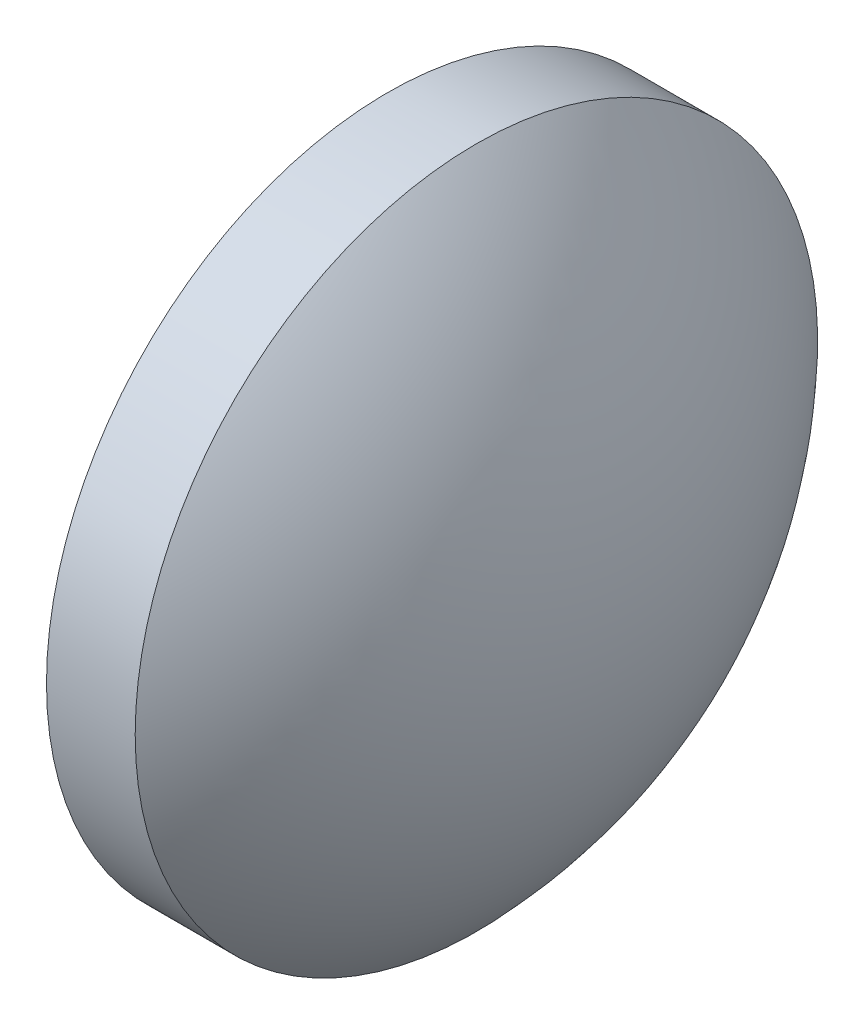
ISO-10303-21;
HEADER;
FILE_DESCRIPTION(('STEP AP214'),'2;1');
FILE_NAME('part.step','',(''),(''),'','','');
FILE_SCHEMA(('AUTOMOTIVE_DESIGN { 1 0 10303 214 1 1 1 1 }'));
ENDSEC;
DATA;
#1=APPLICATION_CONTEXT('core data for automotive mechanical design processes');
#2=APPLICATION_PROTOCOL_DEFINITION('international standard','automotive_design',2000,#1);
#3=PRODUCT_CONTEXT('',#1,'mechanical');
#4=PRODUCT('Part','Part','',(#3));
#5=PRODUCT_RELATED_PRODUCT_CATEGORY('part','',(#4));
#6=PRODUCT_DEFINITION_FORMATION('','',#4);
#7=PRODUCT_DEFINITION_CONTEXT('part definition',#1,'design');
#8=PRODUCT_DEFINITION('design','',#6,#7);
#9=PRODUCT_DEFINITION_SHAPE('','',#8);
#10=(LENGTH_UNIT() NAMED_UNIT(*) SI_UNIT(.MILLI.,.METRE.));
#11=(NAMED_UNIT(*) PLANE_ANGLE_UNIT() SI_UNIT($,.RADIAN.));
#12=(NAMED_UNIT(*) SI_UNIT($,.STERADIAN.) SOLID_ANGLE_UNIT());
#13=UNCERTAINTY_MEASURE_WITH_UNIT(LENGTH_MEASURE(1.E-05),#10,'distance_accuracy_value','');
#14=(GEOMETRIC_REPRESENTATION_CONTEXT(3) GLOBAL_UNCERTAINTY_ASSIGNED_CONTEXT((#13)) GLOBAL_UNIT_ASSIGNED_CONTEXT((#10,
#11,#12)) REPRESENTATION_CONTEXT('',''));
#15=CARTESIAN_POINT('',(0.,0.,0.));
#16=DIRECTION('',(0.,0.,1.));
#17=DIRECTION('',(1.,0.,0.));
#18=AXIS2_PLACEMENT_3D('',#15,#16,#17);
#19=CARTESIAN_POINT('',(404.646593974944,122.183330376329,0.));
#20=DIRECTION('',(-1.,0.,0.));
#21=DIRECTION('',(0.,1.,0.));
#22=AXIS2_PLACEMENT_3D('',#19,#20,#21);
#23=SPHERICAL_SURFACE('',#22,7.25000000000003);
#24=CARTESIAN_POINT('',(409.896593974944,122.183330376329,0.));
#25=DIRECTION('',(-1.,0.,0.));
#26=DIRECTION('',(0.,0.,1.));
#27=AXIS2_PLACEMENT_3D('',#24,#25,#26);
#28=CIRCLE('',#27,4.99999999999999);
#29=CARTESIAN_POINT('',(409.896593974944,122.183330376329,4.99999999999999));
#30=VERTEX_POINT('',#29);
#31=EDGE_CURVE('E10',#30,#30,#28,.T.);
#32=ORIENTED_EDGE('',*,*,#31,.F.);
#33=EDGE_LOOP('',(#32));
#34=FACE_BOUND('',#33,.T.);
#35=ADVANCED_FACE('F35',(#34),#23,.T.);
#36=CARTESIAN_POINT('',(407.454364282499,122.183330376329,0.));
#37=DIRECTION('',(-1.,0.,0.));
#38=DIRECTION('',(0.,0.,1.));
#39=AXIS2_PLACEMENT_3D('',#36,#37,#38);
#40=CYLINDRICAL_SURFACE('',#39,4.99999999999999);
#41=CARTESIAN_POINT('',(408.596593974944,122.183330376329,0.));
#42=DIRECTION('',(-1.,0.,0.));
#43=DIRECTION('',(0.,0.,1.));
#44=AXIS2_PLACEMENT_3D('',#41,#42,#43);
#45=CIRCLE('',#44,4.99999999999999);
#46=CARTESIAN_POINT('',(408.596593974944,122.183330376329,4.99999999999999));
#47=VERTEX_POINT('',#46);
#48=EDGE_CURVE('E41',#47,#47,#45,.T.);
#49=ORIENTED_EDGE('',*,*,#48,.F.);
#50=EDGE_LOOP('',(#49));
#51=FACE_BOUND('',#50,.T.);
#52=ORIENTED_EDGE('',*,*,#31,.T.);
#53=EDGE_LOOP('',(#52));
#54=FACE_BOUND('',#53,.T.);
#55=ADVANCED_FACE('F49',(#51,#54),#40,.T.);
#56=CARTESIAN_POINT('',(408.596593974944,122.183330376329,0.));
#57=DIRECTION('',(1.,0.,0.));
#58=DIRECTION('',(0.,0.,-1.));
#59=AXIS2_PLACEMENT_3D('',#56,#57,#58);
#60=PLANE('',#59);
#61=ORIENTED_EDGE('',*,*,#48,.T.);
#62=EDGE_LOOP('',(#61));
#63=FACE_BOUND('',#62,.T.);
#64=ADVANCED_FACE('F47',(#63),#60,.F.);
#65=CLOSED_SHELL('',(#35,#55,#64));
#66=MANIFOLD_SOLID_BREP('B2',#65);
#67=ADVANCED_BREP_SHAPE_REPRESENTATION('',(#18,#66),#14);
#68=SHAPE_DEFINITION_REPRESENTATION(#9,#67);
ENDSEC;
END-ISO-10303-21;
